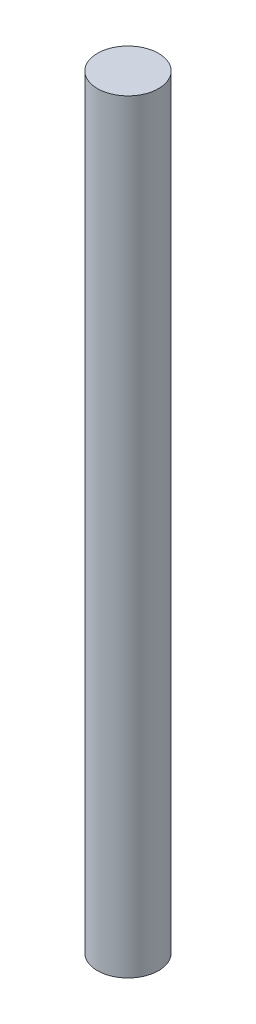
ISO-10303-21;
HEADER;
FILE_DESCRIPTION(('STEP AP214'),'2;1');
FILE_NAME('part.step','',(''),(''),'','','');
FILE_SCHEMA(('AUTOMOTIVE_DESIGN { 1 0 10303 214 1 1 1 1 }'));
ENDSEC;
DATA;
#1=APPLICATION_CONTEXT('core data for automotive mechanical design processes');
#2=APPLICATION_PROTOCOL_DEFINITION('international standard','automotive_design',2000,#1);
#3=PRODUCT_CONTEXT('',#1,'mechanical');
#4=PRODUCT('Part','Part','',(#3));
#5=PRODUCT_RELATED_PRODUCT_CATEGORY('part','',(#4));
#6=PRODUCT_DEFINITION_FORMATION('','',#4);
#7=PRODUCT_DEFINITION_CONTEXT('part definition',#1,'design');
#8=PRODUCT_DEFINITION('design','',#6,#7);
#9=PRODUCT_DEFINITION_SHAPE('','',#8);
#10=(LENGTH_UNIT() NAMED_UNIT(*) SI_UNIT(.MILLI.,.METRE.));
#11=(NAMED_UNIT(*) PLANE_ANGLE_UNIT() SI_UNIT($,.RADIAN.));
#12=(NAMED_UNIT(*) SI_UNIT($,.STERADIAN.) SOLID_ANGLE_UNIT());
#13=UNCERTAINTY_MEASURE_WITH_UNIT(LENGTH_MEASURE(1.E-05),#10,'distance_accuracy_value','');
#14=(GEOMETRIC_REPRESENTATION_CONTEXT(3) GLOBAL_UNCERTAINTY_ASSIGNED_CONTEXT((#13)) GLOBAL_UNIT_ASSIGNED_CONTEXT((#10,
#11,#12)) REPRESENTATION_CONTEXT('',''));
#15=CARTESIAN_POINT('',(0.,0.,0.));
#16=DIRECTION('',(0.,0.,1.));
#17=DIRECTION('',(1.,0.,0.));
#18=AXIS2_PLACEMENT_3D('',#15,#16,#17);
#19=CARTESIAN_POINT('',(0.,100.,0.));
#20=DIRECTION('',(0.,-1.,0.));
#21=DIRECTION('',(0.,0.,-1.));
#22=AXIS2_PLACEMENT_3D('',#19,#20,#21);
#23=CYLINDRICAL_SURFACE('',#22,4.);
#24=CARTESIAN_POINT('',(0.,100.,0.));
#25=DIRECTION('',(0.,1.,0.));
#26=DIRECTION('',(0.,0.,1.));
#27=AXIS2_PLACEMENT_3D('',#24,#25,#26);
#28=CIRCLE('',#27,4.);
#29=CARTESIAN_POINT('',(0.,100.,4.));
#30=VERTEX_POINT('',#29);
#31=EDGE_CURVE('E10',#30,#30,#28,.T.);
#32=ORIENTED_EDGE('',*,*,#31,.F.);
#33=EDGE_LOOP('',(#32));
#34=FACE_BOUND('',#33,.T.);
#35=CARTESIAN_POINT('',(0.,0.,0.));
#36=DIRECTION('',(0.,1.,0.));
#37=DIRECTION('',(0.,0.,1.));
#38=AXIS2_PLACEMENT_3D('',#35,#36,#37);
#39=CIRCLE('',#38,4.);
#40=CARTESIAN_POINT('',(0.,0.,4.));
#41=VERTEX_POINT('',#40);
#42=EDGE_CURVE('E40',#41,#41,#39,.T.);
#43=ORIENTED_EDGE('',*,*,#42,.T.);
#44=EDGE_LOOP('',(#43));
#45=FACE_BOUND('',#44,.T.);
#46=ADVANCED_FACE('F37',(#34,#45),#23,.T.);
#47=CARTESIAN_POINT('',(0.,100.,0.));
#48=DIRECTION('',(0.,1.,0.));
#49=DIRECTION('',(0.,0.,1.));
#50=AXIS2_PLACEMENT_3D('',#47,#48,#49);
#51=PLANE('',#50);
#52=ORIENTED_EDGE('',*,*,#31,.T.);
#53=EDGE_LOOP('',(#52));
#54=FACE_BOUND('',#53,.T.);
#55=ADVANCED_FACE('F52',(#54),#51,.T.);
#56=CARTESIAN_POINT('',(0.,0.,0.));
#57=DIRECTION('',(0.,1.,0.));
#58=DIRECTION('',(0.,0.,1.));
#59=AXIS2_PLACEMENT_3D('',#56,#57,#58);
#60=PLANE('',#59);
#61=ORIENTED_EDGE('',*,*,#42,.F.);
#62=EDGE_LOOP('',(#61));
#63=FACE_BOUND('',#62,.T.);
#64=ADVANCED_FACE('F50',(#63),#60,.F.);
#65=CLOSED_SHELL('',(#46,#55,#64));
#66=MANIFOLD_SOLID_BREP('B2',#65);
#67=ADVANCED_BREP_SHAPE_REPRESENTATION('',(#18,#66),#14);
#68=SHAPE_DEFINITION_REPRESENTATION(#9,#67);
ENDSEC;
END-ISO-10303-21;
